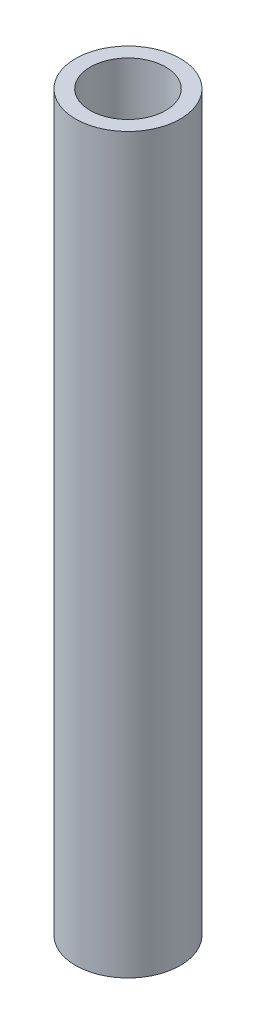
ISO-10303-21;
HEADER;
FILE_DESCRIPTION(('STEP AP214'),'2;1');
FILE_NAME('part.step','',(''),(''),'','','');
FILE_SCHEMA(('AUTOMOTIVE_DESIGN { 1 0 10303 214 1 1 1 1 }'));
ENDSEC;
DATA;
#1=APPLICATION_CONTEXT('core data for automotive mechanical design processes');
#2=APPLICATION_PROTOCOL_DEFINITION('international standard','automotive_design',2000,#1);
#3=PRODUCT_CONTEXT('',#1,'mechanical');
#4=PRODUCT('Part','Part','',(#3));
#5=PRODUCT_RELATED_PRODUCT_CATEGORY('part','',(#4));
#6=PRODUCT_DEFINITION_FORMATION('','',#4);
#7=PRODUCT_DEFINITION_CONTEXT('part definition',#1,'design');
#8=PRODUCT_DEFINITION('design','',#6,#7);
#9=PRODUCT_DEFINITION_SHAPE('','',#8);
#10=(LENGTH_UNIT() NAMED_UNIT(*) SI_UNIT(.MILLI.,.METRE.));
#11=(NAMED_UNIT(*) PLANE_ANGLE_UNIT() SI_UNIT($,.RADIAN.));
#12=(NAMED_UNIT(*) SI_UNIT($,.STERADIAN.) SOLID_ANGLE_UNIT());
#13=UNCERTAINTY_MEASURE_WITH_UNIT(LENGTH_MEASURE(1.E-05),#10,'distance_accuracy_value','');
#14=(GEOMETRIC_REPRESENTATION_CONTEXT(3) GLOBAL_UNCERTAINTY_ASSIGNED_CONTEXT((#13)) GLOBAL_UNIT_ASSIGNED_CONTEXT((#10,
#11,#12)) REPRESENTATION_CONTEXT('',''));
#15=CARTESIAN_POINT('',(0.,0.,0.));
#16=DIRECTION('',(0.,0.,1.));
#17=DIRECTION('',(1.,0.,0.));
#18=AXIS2_PLACEMENT_3D('',#15,#16,#17);
#19=CARTESIAN_POINT('',(0.,44.45,0.));
#20=DIRECTION('',(0.,1.,0.));
#21=DIRECTION('',(0.,0.,1.));
#22=AXIS2_PLACEMENT_3D('',#19,#20,#21);
#23=PLANE('',#22);
#24=CARTESIAN_POINT('',(0.,44.45,0.));
#25=DIRECTION('',(0.,1.,0.));
#26=DIRECTION('',(0.,0.,1.));
#27=AXIS2_PLACEMENT_3D('',#24,#25,#26);
#28=CIRCLE('',#27,3.175);
#29=CARTESIAN_POINT('',(0.,44.45,3.175));
#30=VERTEX_POINT('',#29);
#31=EDGE_CURVE('E10',#30,#30,#28,.T.);
#32=ORIENTED_EDGE('',*,*,#31,.T.);
#33=EDGE_LOOP('',(#32));
#34=FACE_BOUND('',#33,.T.);
#35=CARTESIAN_POINT('',(0.,44.45,0.));
#36=DIRECTION('',(0.,1.,0.));
#37=DIRECTION('',(0.,0.,1.));
#38=AXIS2_PLACEMENT_3D('',#35,#36,#37);
#39=CIRCLE('',#38,2.286);
#40=CARTESIAN_POINT('',(0.,44.45,2.286));
#41=VERTEX_POINT('',#40);
#42=EDGE_CURVE('E50',#41,#41,#39,.T.);
#43=ORIENTED_EDGE('',*,*,#42,.F.);
#44=EDGE_LOOP('',(#43));
#45=FACE_BOUND('',#44,.T.);
#46=ADVANCED_FACE('F37',(#34,#45),#23,.T.);
#47=CARTESIAN_POINT('',(0.,0.,0.));
#48=DIRECTION('',(0.,1.,0.));
#49=DIRECTION('',(0.,0.,1.));
#50=AXIS2_PLACEMENT_3D('',#47,#48,#49);
#51=PLANE('',#50);
#52=CARTESIAN_POINT('',(0.,0.,0.));
#53=DIRECTION('',(0.,1.,0.));
#54=DIRECTION('',(0.,0.,1.));
#55=AXIS2_PLACEMENT_3D('',#52,#53,#54);
#56=CIRCLE('',#55,3.175);
#57=CARTESIAN_POINT('',(0.,0.,3.175));
#58=VERTEX_POINT('',#57);
#59=EDGE_CURVE('E41',#58,#58,#56,.T.);
#60=ORIENTED_EDGE('',*,*,#59,.F.);
#61=EDGE_LOOP('',(#60));
#62=FACE_BOUND('',#61,.T.);
#63=CARTESIAN_POINT('',(0.,0.,0.));
#64=DIRECTION('',(0.,1.,0.));
#65=DIRECTION('',(0.,0.,1.));
#66=AXIS2_PLACEMENT_3D('',#63,#64,#65);
#67=CIRCLE('',#66,2.286);
#68=CARTESIAN_POINT('',(0.,0.,2.286));
#69=VERTEX_POINT('',#68);
#70=EDGE_CURVE('E52',#69,#69,#67,.T.);
#71=ORIENTED_EDGE('',*,*,#70,.T.);
#72=EDGE_LOOP('',(#71));
#73=FACE_BOUND('',#72,.T.);
#74=ADVANCED_FACE('F64',(#62,#73),#51,.F.);
#75=CARTESIAN_POINT('',(0.,44.45,0.));
#76=DIRECTION('',(0.,-1.,0.));
#77=DIRECTION('',(0.,0.,-1.));
#78=AXIS2_PLACEMENT_3D('',#75,#76,#77);
#79=CYLINDRICAL_SURFACE('',#78,3.175);
#80=ORIENTED_EDGE('',*,*,#31,.F.);
#81=EDGE_LOOP('',(#80));
#82=FACE_BOUND('',#81,.T.);
#83=ORIENTED_EDGE('',*,*,#59,.T.);
#84=EDGE_LOOP('',(#83));
#85=FACE_BOUND('',#84,.T.);
#86=ADVANCED_FACE('F39',(#82,#85),#79,.T.);
#87=CARTESIAN_POINT('',(0.,44.45,0.));
#88=DIRECTION('',(0.,-1.,0.));
#89=DIRECTION('',(0.,0.,-1.));
#90=AXIS2_PLACEMENT_3D('',#87,#88,#89);
#91=CYLINDRICAL_SURFACE('',#90,2.286);
#92=ORIENTED_EDGE('',*,*,#42,.T.);
#93=EDGE_LOOP('',(#92));
#94=FACE_BOUND('',#93,.T.);
#95=ORIENTED_EDGE('',*,*,#70,.F.);
#96=EDGE_LOOP('',(#95));
#97=FACE_BOUND('',#96,.T.);
#98=ADVANCED_FACE('F60',(#94,#97),#91,.F.);
#99=CLOSED_SHELL('',(#46,#74,#86,#98));
#100=MANIFOLD_SOLID_BREP('B2',#99);
#101=ADVANCED_BREP_SHAPE_REPRESENTATION('',(#18,#100),#14);
#102=SHAPE_DEFINITION_REPRESENTATION(#9,#101);
ENDSEC;
END-ISO-10303-21;
